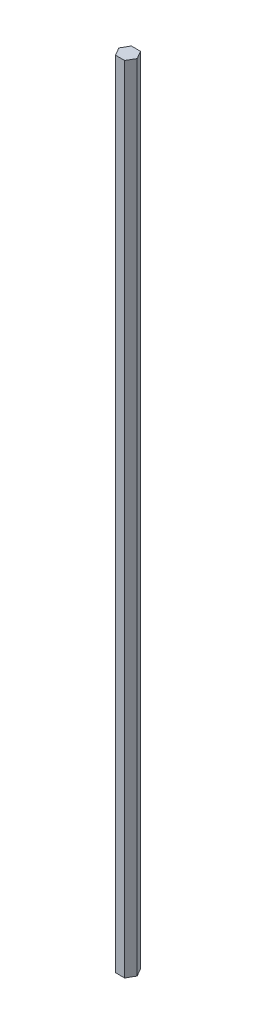
ISO-10303-21;
HEADER;
FILE_DESCRIPTION(('STEP AP214'),'2;1');
FILE_NAME('part.step','',(''),(''),'','','');
FILE_SCHEMA(('AUTOMOTIVE_DESIGN { 1 0 10303 214 1 1 1 1 }'));
ENDSEC;
DATA;
#1=APPLICATION_CONTEXT('core data for automotive mechanical design processes');
#2=APPLICATION_PROTOCOL_DEFINITION('international standard','automotive_design',2000,#1);
#3=PRODUCT_CONTEXT('',#1,'mechanical');
#4=PRODUCT('Part','Part','',(#3));
#5=PRODUCT_RELATED_PRODUCT_CATEGORY('part','',(#4));
#6=PRODUCT_DEFINITION_FORMATION('','',#4);
#7=PRODUCT_DEFINITION_CONTEXT('part definition',#1,'design');
#8=PRODUCT_DEFINITION('design','',#6,#7);
#9=PRODUCT_DEFINITION_SHAPE('','',#8);
#10=(LENGTH_UNIT() NAMED_UNIT(*) SI_UNIT(.MILLI.,.METRE.));
#11=(NAMED_UNIT(*) PLANE_ANGLE_UNIT() SI_UNIT($,.RADIAN.));
#12=(NAMED_UNIT(*) SI_UNIT($,.STERADIAN.) SOLID_ANGLE_UNIT());
#13=UNCERTAINTY_MEASURE_WITH_UNIT(LENGTH_MEASURE(1.E-05),#10,'distance_accuracy_value','');
#14=(GEOMETRIC_REPRESENTATION_CONTEXT(3) GLOBAL_UNCERTAINTY_ASSIGNED_CONTEXT((#13)) GLOBAL_UNIT_ASSIGNED_CONTEXT((#10,
#11,#12)) REPRESENTATION_CONTEXT('',''));
#15=CARTESIAN_POINT('',(0.,0.,0.));
#16=DIRECTION('',(0.,0.,1.));
#17=DIRECTION('',(1.,0.,0.));
#18=AXIS2_PLACEMENT_3D('',#15,#16,#17);
#19=CARTESIAN_POINT('',(-3.66617420935413,635.,6.35));
#20=DIRECTION('',(0.,0.,-1.));
#21=DIRECTION('',(-1.,0.,0.));
#22=AXIS2_PLACEMENT_3D('',#19,#20,#21);
#23=PLANE('',#22);
#24=DIRECTION('',(1.,0.,0.));
#25=VECTOR('',#24,1.);
#26=CARTESIAN_POINT('',(-3.66617420935413,0.,6.35));
#27=LINE('',#26,#25);
#28=CARTESIAN_POINT('',(-3.66617420935413,0.,6.35));
#29=VERTEX_POINT('',#28);
#30=CARTESIAN_POINT('',(3.66617420935412,0.,6.34999999999999));
#31=VERTEX_POINT('',#30);
#32=EDGE_CURVE('E119',#29,#31,#27,.T.);
#33=ORIENTED_EDGE('',*,*,#32,.T.);
#34=DIRECTION('',(0.,-1.,0.));
#35=VECTOR('',#34,1.);
#36=CARTESIAN_POINT('',(3.66617420935412,635.,6.34999999999999));
#37=LINE('',#36,#35);
#38=CARTESIAN_POINT('',(3.66617420935412,635.,6.34999999999999));
#39=VERTEX_POINT('',#38);
#40=EDGE_CURVE('E11',#39,#31,#37,.T.);
#41=ORIENTED_EDGE('',*,*,#40,.F.);
#42=DIRECTION('',(1.,0.,0.));
#43=VECTOR('',#42,1.);
#44=CARTESIAN_POINT('',(-3.66617420935413,635.,6.35));
#45=LINE('',#44,#43);
#46=CARTESIAN_POINT('',(-3.66617420935413,635.,6.35));
#47=VERTEX_POINT('',#46);
#48=EDGE_CURVE('E129',#47,#39,#45,.T.);
#49=ORIENTED_EDGE('',*,*,#48,.F.);
#50=DIRECTION('',(0.,-1.,0.));
#51=VECTOR('',#50,1.);
#52=CARTESIAN_POINT('',(-3.66617420935413,635.,6.35));
#53=LINE('',#52,#51);
#54=EDGE_CURVE('E115',#47,#29,#53,.T.);
#55=ORIENTED_EDGE('',*,*,#54,.T.);
#56=EDGE_LOOP('',(#33,#41,#49,#55));
#57=FACE_BOUND('',#56,.T.);
#58=ADVANCED_FACE('F35',(#57),#23,.F.);
#59=CARTESIAN_POINT('',(3.66617420935412,635.,6.34999999999999));
#60=DIRECTION('',(-0.866025403784439,0.,-0.5));
#61=DIRECTION('',(-0.5,0.,0.866025403784439));
#62=AXIS2_PLACEMENT_3D('',#59,#60,#61);
#63=PLANE('',#62);
#64=DIRECTION('',(0.5,0.,-0.866025403784439));
#65=VECTOR('',#64,1.);
#66=CARTESIAN_POINT('',(3.66617420935412,0.,6.34999999999999));
#67=LINE('',#66,#65);
#68=CARTESIAN_POINT('',(7.33234841870824,0.,0.));
#69=VERTEX_POINT('',#68);
#70=EDGE_CURVE('E122',#31,#69,#67,.T.);
#71=ORIENTED_EDGE('',*,*,#70,.T.);
#72=DIRECTION('',(0.,-1.,0.));
#73=VECTOR('',#72,1.);
#74=CARTESIAN_POINT('',(7.33234841870824,635.,0.));
#75=LINE('',#74,#73);
#76=CARTESIAN_POINT('',(7.33234841870824,635.,0.));
#77=VERTEX_POINT('',#76);
#78=EDGE_CURVE('E43',#77,#69,#75,.T.);
#79=ORIENTED_EDGE('',*,*,#78,.F.);
#80=DIRECTION('',(0.5,0.,-0.866025403784439));
#81=VECTOR('',#80,1.);
#82=CARTESIAN_POINT('',(3.66617420935412,635.,6.34999999999999));
#83=LINE('',#82,#81);
#84=EDGE_CURVE('E88',#39,#77,#83,.T.);
#85=ORIENTED_EDGE('',*,*,#84,.F.);
#86=ORIENTED_EDGE('',*,*,#40,.T.);
#87=EDGE_LOOP('',(#71,#79,#85,#86));
#88=FACE_BOUND('',#87,.T.);
#89=ADVANCED_FACE('F153',(#88),#63,.F.);
#90=CARTESIAN_POINT('',(7.33234841870824,635.,0.));
#91=DIRECTION('',(-0.866025403784439,0.,0.5));
#92=DIRECTION('',(0.5,0.,0.866025403784439));
#93=AXIS2_PLACEMENT_3D('',#90,#91,#92);
#94=PLANE('',#93);
#95=DIRECTION('',(-0.5,0.,-0.866025403784439));
#96=VECTOR('',#95,1.);
#97=CARTESIAN_POINT('',(7.33234841870824,0.,0.));
#98=LINE('',#97,#96);
#99=CARTESIAN_POINT('',(3.66617420935413,0.,-6.35));
#100=VERTEX_POINT('',#99);
#101=EDGE_CURVE('E124',#69,#100,#98,.T.);
#102=ORIENTED_EDGE('',*,*,#101,.T.);
#103=DIRECTION('',(0.,-1.,0.));
#104=VECTOR('',#103,1.);
#105=CARTESIAN_POINT('',(3.66617420935413,635.,-6.35));
#106=LINE('',#105,#104);
#107=CARTESIAN_POINT('',(3.66617420935413,635.,-6.35));
#108=VERTEX_POINT('',#107);
#109=EDGE_CURVE('E110',#108,#100,#106,.T.);
#110=ORIENTED_EDGE('',*,*,#109,.F.);
#111=DIRECTION('',(-0.5,0.,-0.866025403784439));
#112=VECTOR('',#111,1.);
#113=CARTESIAN_POINT('',(7.33234841870824,635.,0.));
#114=LINE('',#113,#112);
#115=EDGE_CURVE('E101',#77,#108,#114,.T.);
#116=ORIENTED_EDGE('',*,*,#115,.F.);
#117=ORIENTED_EDGE('',*,*,#78,.T.);
#118=EDGE_LOOP('',(#102,#110,#116,#117));
#119=FACE_BOUND('',#118,.T.);
#120=ADVANCED_FACE('F135',(#119),#94,.F.);
#121=CARTESIAN_POINT('',(3.66617420935413,635.,-6.35));
#122=DIRECTION('',(0.,0.,1.));
#123=DIRECTION('',(1.,0.,0.));
#124=AXIS2_PLACEMENT_3D('',#121,#122,#123);
#125=PLANE('',#124);
#126=DIRECTION('',(-1.,0.,0.));
#127=VECTOR('',#126,1.);
#128=CARTESIAN_POINT('',(3.66617420935413,0.,-6.35));
#129=LINE('',#128,#127);
#130=CARTESIAN_POINT('',(-3.66617420935412,0.,-6.35));
#131=VERTEX_POINT('',#130);
#132=EDGE_CURVE('E109',#100,#131,#129,.T.);
#133=ORIENTED_EDGE('',*,*,#132,.T.);
#134=DIRECTION('',(0.,-1.,0.));
#135=VECTOR('',#134,1.);
#136=CARTESIAN_POINT('',(-3.66617420935412,635.,-6.35));
#137=LINE('',#136,#135);
#138=CARTESIAN_POINT('',(-3.66617420935412,635.,-6.35));
#139=VERTEX_POINT('',#138);
#140=EDGE_CURVE('E106',#139,#131,#137,.T.);
#141=ORIENTED_EDGE('',*,*,#140,.F.);
#142=DIRECTION('',(-1.,0.,0.));
#143=VECTOR('',#142,1.);
#144=CARTESIAN_POINT('',(3.66617420935413,635.,-6.35));
#145=LINE('',#144,#143);
#146=EDGE_CURVE('E95',#108,#139,#145,.T.);
#147=ORIENTED_EDGE('',*,*,#146,.F.);
#148=ORIENTED_EDGE('',*,*,#109,.T.);
#149=EDGE_LOOP('',(#133,#141,#147,#148));
#150=FACE_BOUND('',#149,.T.);
#151=ADVANCED_FACE('F107',(#150),#125,.F.);
#152=CARTESIAN_POINT('',(-3.66617420935412,635.,-6.35));
#153=DIRECTION('',(0.866025403784438,0.,0.5));
#154=DIRECTION('',(0.5,0.,-0.866025403784439));
#155=AXIS2_PLACEMENT_3D('',#152,#153,#154);
#156=PLANE('',#155);
#157=DIRECTION('',(-0.5,0.,0.866025403784438));
#158=VECTOR('',#157,1.);
#159=CARTESIAN_POINT('',(-3.66617420935412,0.,-6.35));
#160=LINE('',#159,#158);
#161=CARTESIAN_POINT('',(-7.33234841870825,0.,0.));
#162=VERTEX_POINT('',#161);
#163=EDGE_CURVE('E74',#131,#162,#160,.T.);
#164=ORIENTED_EDGE('',*,*,#163,.T.);
#165=DIRECTION('',(0.,-1.,0.));
#166=VECTOR('',#165,1.);
#167=CARTESIAN_POINT('',(-7.33234841870825,635.,0.));
#168=LINE('',#167,#166);
#169=CARTESIAN_POINT('',(-7.33234841870825,635.,0.));
#170=VERTEX_POINT('',#169);
#171=EDGE_CURVE('E111',#170,#162,#168,.T.);
#172=ORIENTED_EDGE('',*,*,#171,.F.);
#173=DIRECTION('',(-0.5,0.,0.866025403784438));
#174=VECTOR('',#173,1.);
#175=CARTESIAN_POINT('',(-3.66617420935412,635.,-6.35));
#176=LINE('',#175,#174);
#177=EDGE_CURVE('E99',#139,#170,#176,.T.);
#178=ORIENTED_EDGE('',*,*,#177,.F.);
#179=ORIENTED_EDGE('',*,*,#140,.T.);
#180=EDGE_LOOP('',(#164,#172,#178,#179));
#181=FACE_BOUND('',#180,.T.);
#182=ADVANCED_FACE('F113',(#181),#156,.F.);
#183=CARTESIAN_POINT('',(-7.33234841870825,635.,0.));
#184=DIRECTION('',(0.866025403784439,0.,-0.5));
#185=DIRECTION('',(-0.5,0.,-0.866025403784439));
#186=AXIS2_PLACEMENT_3D('',#183,#184,#185);
#187=PLANE('',#186);
#188=DIRECTION('',(0.5,0.,0.866025403784439));
#189=VECTOR('',#188,1.);
#190=CARTESIAN_POINT('',(-7.33234841870825,0.,0.));
#191=LINE('',#190,#189);
#192=EDGE_CURVE('E80',#162,#29,#191,.T.);
#193=ORIENTED_EDGE('',*,*,#192,.T.);
#194=ORIENTED_EDGE('',*,*,#54,.F.);
#195=DIRECTION('',(0.5,0.,0.866025403784439));
#196=VECTOR('',#195,1.);
#197=CARTESIAN_POINT('',(-7.33234841870825,635.,0.));
#198=LINE('',#197,#196);
#199=EDGE_CURVE('E51',#170,#47,#198,.T.);
#200=ORIENTED_EDGE('',*,*,#199,.F.);
#201=ORIENTED_EDGE('',*,*,#171,.T.);
#202=EDGE_LOOP('',(#193,#194,#200,#201));
#203=FACE_BOUND('',#202,.T.);
#204=ADVANCED_FACE('F142',(#203),#187,.F.);
#205=CARTESIAN_POINT('',(0.,635.,0.));
#206=DIRECTION('',(0.,1.,0.));
#207=DIRECTION('',(0.,0.,1.));
#208=AXIS2_PLACEMENT_3D('',#205,#206,#207);
#209=PLANE('',#208);
#210=ORIENTED_EDGE('',*,*,#48,.T.);
#211=ORIENTED_EDGE('',*,*,#84,.T.);
#212=ORIENTED_EDGE('',*,*,#115,.T.);
#213=ORIENTED_EDGE('',*,*,#146,.T.);
#214=ORIENTED_EDGE('',*,*,#177,.T.);
#215=ORIENTED_EDGE('',*,*,#199,.T.);
#216=EDGE_LOOP('',(#210,#211,#212,#213,#214,#215));
#217=FACE_BOUND('',#216,.T.);
#218=ADVANCED_FACE('F97',(#217),#209,.T.);
#219=CARTESIAN_POINT('',(0.,0.,0.));
#220=DIRECTION('',(0.,1.,0.));
#221=DIRECTION('',(0.,0.,1.));
#222=AXIS2_PLACEMENT_3D('',#219,#220,#221);
#223=PLANE('',#222);
#224=ORIENTED_EDGE('',*,*,#32,.F.);
#225=ORIENTED_EDGE('',*,*,#192,.F.);
#226=ORIENTED_EDGE('',*,*,#163,.F.);
#227=ORIENTED_EDGE('',*,*,#132,.F.);
#228=ORIENTED_EDGE('',*,*,#101,.F.);
#229=ORIENTED_EDGE('',*,*,#70,.F.);
#230=EDGE_LOOP('',(#224,#225,#226,#227,#228,#229));
#231=FACE_BOUND('',#230,.T.);
#232=ADVANCED_FACE('F138',(#231),#223,.F.);
#233=CLOSED_SHELL('',(#58,#89,#120,#151,#182,#204,#218,#232));
#234=MANIFOLD_SOLID_BREP('B2',#233);
#235=ADVANCED_BREP_SHAPE_REPRESENTATION('',(#18,#234),#14);
#236=SHAPE_DEFINITION_REPRESENTATION(#9,#235);
ENDSEC;
END-ISO-10303-21;
